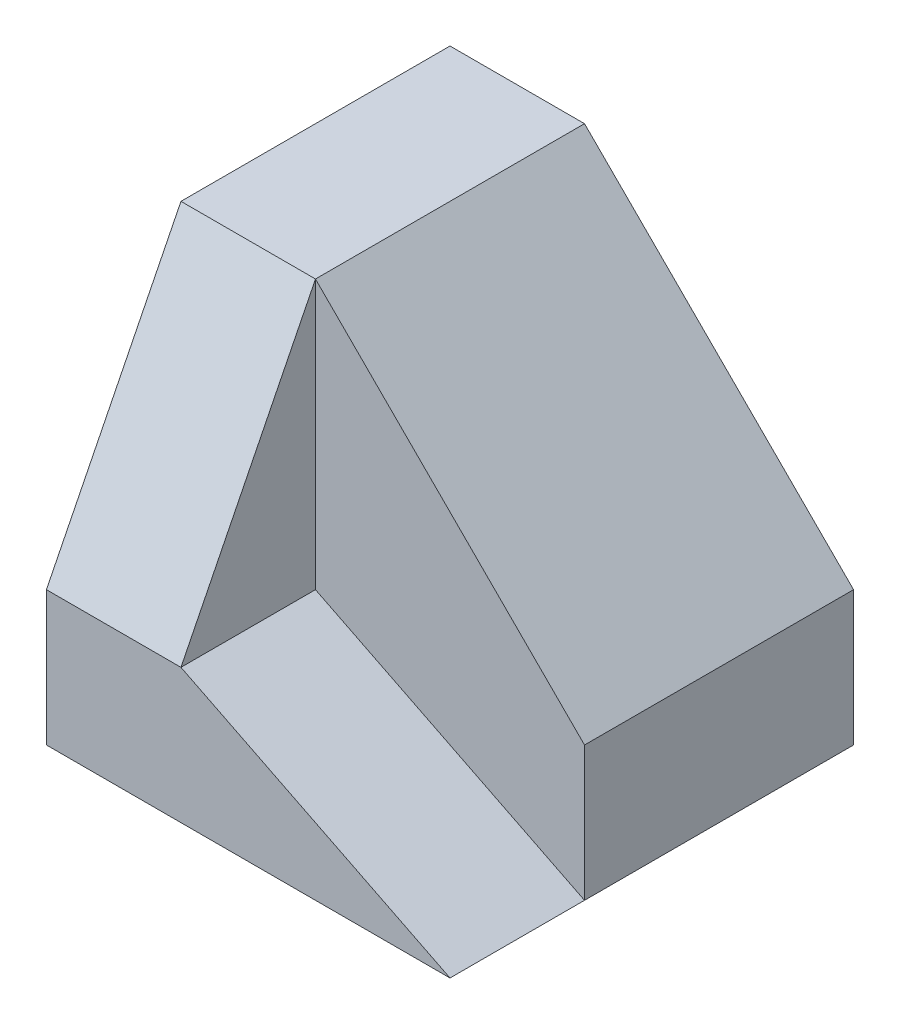
ISO-10303-21;
HEADER;
FILE_DESCRIPTION(('STEP AP214'),'2;1');
FILE_NAME('part.step','',(''),(''),'','','');
FILE_SCHEMA(('AUTOMOTIVE_DESIGN { 1 0 10303 214 1 1 1 1 }'));
ENDSEC;
DATA;
#1=APPLICATION_CONTEXT('core data for automotive mechanical design processes');
#2=APPLICATION_PROTOCOL_DEFINITION('international standard','automotive_design',2000,#1);
#3=PRODUCT_CONTEXT('',#1,'mechanical');
#4=PRODUCT('Part','Part','',(#3));
#5=PRODUCT_RELATED_PRODUCT_CATEGORY('part','',(#4));
#6=PRODUCT_DEFINITION_FORMATION('','',#4);
#7=PRODUCT_DEFINITION_CONTEXT('part definition',#1,'design');
#8=PRODUCT_DEFINITION('design','',#6,#7);
#9=PRODUCT_DEFINITION_SHAPE('','',#8);
#10=(LENGTH_UNIT() NAMED_UNIT(*) SI_UNIT(.MILLI.,.METRE.));
#11=(NAMED_UNIT(*) PLANE_ANGLE_UNIT() SI_UNIT($,.RADIAN.));
#12=(NAMED_UNIT(*) SI_UNIT($,.STERADIAN.) SOLID_ANGLE_UNIT());
#13=UNCERTAINTY_MEASURE_WITH_UNIT(LENGTH_MEASURE(1.E-05),#10,'distance_accuracy_value','');
#14=(GEOMETRIC_REPRESENTATION_CONTEXT(3) GLOBAL_UNCERTAINTY_ASSIGNED_CONTEXT((#13)) GLOBAL_UNIT_ASSIGNED_CONTEXT((#10,
#11,#12)) REPRESENTATION_CONTEXT('',''));
#15=CARTESIAN_POINT('',(0.,0.,0.));
#16=DIRECTION('',(0.,0.,1.));
#17=DIRECTION('',(1.,0.,0.));
#18=AXIS2_PLACEMENT_3D('',#15,#16,#17);
#19=CARTESIAN_POINT('',(60.,20.,-60.));
#20=DIRECTION('',(0.707106781186547,0.707106781186547,0.));
#21=DIRECTION('',(-0.707106781186548,0.707106781186548,0.));
#22=AXIS2_PLACEMENT_3D('',#19,#20,#21);
#23=PLANE('',#22);
#24=DIRECTION('',(0.,0.,1.));
#25=VECTOR('',#24,1.);
#26=CARTESIAN_POINT('',(20.,60.,-60.));
#27=LINE('',#26,#25);
#28=CARTESIAN_POINT('',(20.,60.,-60.));
#29=VERTEX_POINT('',#28);
#30=CARTESIAN_POINT('',(20.,60.,-20.));
#31=VERTEX_POINT('',#30);
#32=EDGE_CURVE('E43',#29,#31,#27,.T.);
#33=ORIENTED_EDGE('',*,*,#32,.T.);
#34=DIRECTION('',(-0.707106781186548,0.707106781186548,0.));
#35=VECTOR('',#34,1.);
#36=CARTESIAN_POINT('',(60.,20.,-20.));
#37=LINE('',#36,#35);
#38=CARTESIAN_POINT('',(60.,20.,-20.));
#39=VERTEX_POINT('',#38);
#40=EDGE_CURVE('E145',#39,#31,#37,.T.);
#41=ORIENTED_EDGE('',*,*,#40,.F.);
#42=DIRECTION('',(0.,0.,1.));
#43=VECTOR('',#42,1.);
#44=CARTESIAN_POINT('',(60.,20.,-60.));
#45=LINE('',#44,#43);
#46=CARTESIAN_POINT('',(60.,20.,-60.));
#47=VERTEX_POINT('',#46);
#48=EDGE_CURVE('E121',#47,#39,#45,.T.);
#49=ORIENTED_EDGE('',*,*,#48,.F.);
#50=DIRECTION('',(-0.707106781186548,0.707106781186548,0.));
#51=VECTOR('',#50,1.);
#52=CARTESIAN_POINT('',(60.,20.,-60.));
#53=LINE('',#52,#51);
#54=EDGE_CURVE('E128',#47,#29,#53,.T.);
#55=ORIENTED_EDGE('',*,*,#54,.T.);
#56=EDGE_LOOP('',(#33,#41,#49,#55));
#57=FACE_BOUND('',#56,.T.);
#58=ADVANCED_FACE('F33',(#57),#23,.T.);
#59=CARTESIAN_POINT('',(60.,0.,-60.));
#60=DIRECTION('',(1.,0.,0.));
#61=DIRECTION('',(0.,0.,-1.));
#62=AXIS2_PLACEMENT_3D('',#59,#60,#61);
#63=PLANE('',#62);
#64=ORIENTED_EDGE('',*,*,#48,.T.);
#65=DIRECTION('',(0.,1.,0.));
#66=VECTOR('',#65,1.);
#67=CARTESIAN_POINT('',(60.,0.,-20.));
#68=LINE('',#67,#66);
#69=CARTESIAN_POINT('',(60.,0.,-20.));
#70=VERTEX_POINT('',#69);
#71=EDGE_CURVE('E142',#70,#39,#68,.T.);
#72=ORIENTED_EDGE('',*,*,#71,.F.);
#73=DIRECTION('',(0.,0.,1.));
#74=VECTOR('',#73,1.);
#75=CARTESIAN_POINT('',(60.,0.,-60.));
#76=LINE('',#75,#74);
#77=CARTESIAN_POINT('',(60.,0.,-60.));
#78=VERTEX_POINT('',#77);
#79=EDGE_CURVE('E123',#78,#70,#76,.T.);
#80=ORIENTED_EDGE('',*,*,#79,.F.);
#81=DIRECTION('',(0.,1.,0.));
#82=VECTOR('',#81,1.);
#83=CARTESIAN_POINT('',(60.,0.,-60.));
#84=LINE('',#83,#82);
#85=EDGE_CURVE('E132',#78,#47,#84,.T.);
#86=ORIENTED_EDGE('',*,*,#85,.T.);
#87=EDGE_LOOP('',(#64,#72,#80,#86));
#88=FACE_BOUND('',#87,.T.);
#89=ADVANCED_FACE('F166',(#88),#63,.T.);
#90=CARTESIAN_POINT('',(0.,60.,-60.));
#91=DIRECTION('',(-1.,0.,0.));
#92=DIRECTION('',(0.,-1.,0.));
#93=AXIS2_PLACEMENT_3D('',#90,#91,#92);
#94=PLANE('',#93);
#95=DIRECTION('',(0.,0.894427190999916,-0.447213595499958));
#96=VECTOR('',#95,1.);
#97=CARTESIAN_POINT('',(0.,20.,0.));
#98=LINE('',#97,#96);
#99=CARTESIAN_POINT('',(0.,20.,0.));
#100=VERTEX_POINT('',#99);
#101=CARTESIAN_POINT('',(0.,60.,-20.));
#102=VERTEX_POINT('',#101);
#103=EDGE_CURVE('E87',#100,#102,#98,.T.);
#104=ORIENTED_EDGE('',*,*,#103,.T.);
#105=DIRECTION('',(0.,0.,1.));
#106=VECTOR('',#105,1.);
#107=CARTESIAN_POINT('',(0.,60.,-60.));
#108=LINE('',#107,#106);
#109=CARTESIAN_POINT('',(0.,60.,-60.));
#110=VERTEX_POINT('',#109);
#111=EDGE_CURVE('E11',#110,#102,#108,.T.);
#112=ORIENTED_EDGE('',*,*,#111,.F.);
#113=DIRECTION('',(0.,-1.,0.));
#114=VECTOR('',#113,1.);
#115=CARTESIAN_POINT('',(0.,60.,-60.));
#116=LINE('',#115,#114);
#117=CARTESIAN_POINT('',(0.,0.,-60.));
#118=VERTEX_POINT('',#117);
#119=EDGE_CURVE('E110',#110,#118,#116,.T.);
#120=ORIENTED_EDGE('',*,*,#119,.T.);
#121=DIRECTION('',(0.,0.,1.));
#122=VECTOR('',#121,1.);
#123=CARTESIAN_POINT('',(0.,0.,-60.));
#124=LINE('',#123,#122);
#125=CARTESIAN_POINT('',(0.,0.,0.));
#126=VERTEX_POINT('',#125);
#127=EDGE_CURVE('E37',#118,#126,#124,.T.);
#128=ORIENTED_EDGE('',*,*,#127,.T.);
#129=DIRECTION('',(0.,-1.,0.));
#130=VECTOR('',#129,1.);
#131=CARTESIAN_POINT('',(0.,60.,0.));
#132=LINE('',#131,#130);
#133=EDGE_CURVE('E102',#100,#126,#132,.T.);
#134=ORIENTED_EDGE('',*,*,#133,.F.);
#135=EDGE_LOOP('',(#104,#112,#120,#128,#134));
#136=FACE_BOUND('',#135,.T.);
#137=ADVANCED_FACE('F35',(#136),#94,.T.);
#138=CARTESIAN_POINT('',(20.,60.,-60.));
#139=DIRECTION('',(0.,1.,0.));
#140=DIRECTION('',(0.,0.,1.));
#141=AXIS2_PLACEMENT_3D('',#138,#139,#140);
#142=PLANE('',#141);
#143=DIRECTION('',(1.,0.,0.));
#144=VECTOR('',#143,1.);
#145=CARTESIAN_POINT('',(-0.00100000000000794,60.,-20.));
#146=LINE('',#145,#144);
#147=EDGE_CURVE('E93',#102,#31,#146,.T.);
#148=ORIENTED_EDGE('',*,*,#147,.T.);
#149=ORIENTED_EDGE('',*,*,#32,.F.);
#150=DIRECTION('',(-1.,0.,0.));
#151=VECTOR('',#150,1.);
#152=CARTESIAN_POINT('',(20.,60.,-60.));
#153=LINE('',#152,#151);
#154=EDGE_CURVE('E116',#29,#110,#153,.T.);
#155=ORIENTED_EDGE('',*,*,#154,.T.);
#156=ORIENTED_EDGE('',*,*,#111,.T.);
#157=EDGE_LOOP('',(#148,#149,#155,#156));
#158=FACE_BOUND('',#157,.T.);
#159=ADVANCED_FACE('F158',(#158),#142,.T.);
#160=CARTESIAN_POINT('',(0.,0.,-60.));
#161=DIRECTION('',(0.,-1.,0.));
#162=DIRECTION('',(0.,0.,-1.));
#163=AXIS2_PLACEMENT_3D('',#160,#161,#162);
#164=PLANE('',#163);
#165=DIRECTION('',(1.,0.,0.));
#166=VECTOR('',#165,1.);
#167=CARTESIAN_POINT('',(0.,0.,0.));
#168=LINE('',#167,#166);
#169=CARTESIAN_POINT('',(60.,0.,0.));
#170=VERTEX_POINT('',#169);
#171=EDGE_CURVE('E107',#126,#170,#168,.T.);
#172=ORIENTED_EDGE('',*,*,#171,.F.);
#173=ORIENTED_EDGE('',*,*,#127,.F.);
#174=DIRECTION('',(1.,0.,0.));
#175=VECTOR('',#174,1.);
#176=CARTESIAN_POINT('',(0.,0.,-60.));
#177=LINE('',#176,#175);
#178=EDGE_CURVE('E136',#118,#78,#177,.T.);
#179=ORIENTED_EDGE('',*,*,#178,.T.);
#180=ORIENTED_EDGE('',*,*,#79,.T.);
#181=DIRECTION('',(0.,0.,1.));
#182=VECTOR('',#181,1.);
#183=CARTESIAN_POINT('',(60.,0.,-20.));
#184=LINE('',#183,#182);
#185=EDGE_CURVE('E108',#70,#170,#184,.T.);
#186=ORIENTED_EDGE('',*,*,#185,.T.);
#187=EDGE_LOOP('',(#172,#173,#179,#180,#186));
#188=FACE_BOUND('',#187,.T.);
#189=ADVANCED_FACE('F175',(#188),#164,.T.);
#190=CARTESIAN_POINT('',(0.,0.,-60.));
#191=DIRECTION('',(0.,0.,1.));
#192=DIRECTION('',(1.,0.,0.));
#193=AXIS2_PLACEMENT_3D('',#190,#191,#192);
#194=PLANE('',#193);
#195=ORIENTED_EDGE('',*,*,#119,.F.);
#196=ORIENTED_EDGE('',*,*,#154,.F.);
#197=ORIENTED_EDGE('',*,*,#54,.F.);
#198=ORIENTED_EDGE('',*,*,#85,.F.);
#199=ORIENTED_EDGE('',*,*,#178,.F.);
#200=EDGE_LOOP('',(#195,#196,#197,#198,#199));
#201=FACE_BOUND('',#200,.T.);
#202=ADVANCED_FACE('F177',(#201),#194,.F.);
#203=CARTESIAN_POINT('',(0.,0.,0.));
#204=DIRECTION('',(0.,0.,1.));
#205=DIRECTION('',(1.,0.,0.));
#206=AXIS2_PLACEMENT_3D('',#203,#204,#205);
#207=PLANE('',#206);
#208=DIRECTION('',(1.,0.,0.));
#209=VECTOR('',#208,1.);
#210=CARTESIAN_POINT('',(-0.00100000000000447,20.,0.));
#211=LINE('',#210,#209);
#212=CARTESIAN_POINT('',(20.,20.,0.));
#213=VERTEX_POINT('',#212);
#214=EDGE_CURVE('E90',#100,#213,#211,.T.);
#215=ORIENTED_EDGE('',*,*,#214,.F.);
#216=ORIENTED_EDGE('',*,*,#133,.T.);
#217=ORIENTED_EDGE('',*,*,#171,.T.);
#218=DIRECTION('',(0.894427190999916,-0.447213595499958,0.));
#219=VECTOR('',#218,1.);
#220=CARTESIAN_POINT('',(20.,20.,0.));
#221=LINE('',#220,#219);
#222=EDGE_CURVE('E95',#213,#170,#221,.T.);
#223=ORIENTED_EDGE('',*,*,#222,.F.);
#224=EDGE_LOOP('',(#215,#216,#217,#223));
#225=FACE_BOUND('',#224,.T.);
#226=ADVANCED_FACE('F100',(#225),#207,.T.);
#227=CARTESIAN_POINT('',(20.,20.,-20.));
#228=DIRECTION('',(-0.447213595499958,-0.894427190999916,0.));
#229=DIRECTION('',(0.894427190999916,-0.447213595499958,0.));
#230=AXIS2_PLACEMENT_3D('',#227,#228,#229);
#231=PLANE('',#230);
#232=ORIENTED_EDGE('',*,*,#222,.T.);
#233=ORIENTED_EDGE('',*,*,#185,.F.);
#234=DIRECTION('',(0.894427190999916,-0.447213595499958,0.));
#235=VECTOR('',#234,1.);
#236=CARTESIAN_POINT('',(20.,20.,-20.));
#237=LINE('',#236,#235);
#238=CARTESIAN_POINT('',(20.,20.,-20.));
#239=VERTEX_POINT('',#238);
#240=EDGE_CURVE('E147',#239,#70,#237,.T.);
#241=ORIENTED_EDGE('',*,*,#240,.F.);
#242=DIRECTION('',(0.,0.,1.));
#243=VECTOR('',#242,1.);
#244=CARTESIAN_POINT('',(20.,20.,-20.));
#245=LINE('',#244,#243);
#246=EDGE_CURVE('E113',#239,#213,#245,.T.);
#247=ORIENTED_EDGE('',*,*,#246,.T.);
#248=EDGE_LOOP('',(#232,#233,#241,#247));
#249=FACE_BOUND('',#248,.T.);
#250=ADVANCED_FACE('F186',(#249),#231,.F.);
#251=CARTESIAN_POINT('',(20.,60.,-20.));
#252=DIRECTION('',(-1.,0.,0.));
#253=DIRECTION('',(0.,-1.,0.));
#254=AXIS2_PLACEMENT_3D('',#251,#252,#253);
#255=PLANE('',#254);
#256=DIRECTION('',(0.,-1.,0.));
#257=VECTOR('',#256,1.);
#258=CARTESIAN_POINT('',(20.,60.,-20.));
#259=LINE('',#258,#257);
#260=EDGE_CURVE('E150',#31,#239,#259,.T.);
#261=ORIENTED_EDGE('',*,*,#260,.F.);
#262=DIRECTION('',(0.,0.894427190999916,-0.447213595499958));
#263=VECTOR('',#262,1.);
#264=CARTESIAN_POINT('',(20.,20.,0.));
#265=LINE('',#264,#263);
#266=EDGE_CURVE('E104',#213,#31,#265,.T.);
#267=ORIENTED_EDGE('',*,*,#266,.F.);
#268=ORIENTED_EDGE('',*,*,#246,.F.);
#269=EDGE_LOOP('',(#261,#267,#268));
#270=FACE_BOUND('',#269,.T.);
#271=ADVANCED_FACE('F159',(#270),#255,.F.);
#272=CARTESIAN_POINT('',(0.,0.,-20.));
#273=DIRECTION('',(0.,0.,1.));
#274=DIRECTION('',(1.,0.,0.));
#275=AXIS2_PLACEMENT_3D('',#272,#273,#274);
#276=PLANE('',#275);
#277=ORIENTED_EDGE('',*,*,#40,.T.);
#278=ORIENTED_EDGE('',*,*,#260,.T.);
#279=ORIENTED_EDGE('',*,*,#240,.T.);
#280=ORIENTED_EDGE('',*,*,#71,.T.);
#281=EDGE_LOOP('',(#277,#278,#279,#280));
#282=FACE_BOUND('',#281,.T.);
#283=ADVANCED_FACE('F163',(#282),#276,.T.);
#284=CARTESIAN_POINT('',(-0.00100000000000447,20.,0.));
#285=DIRECTION('',(0.,-0.447213595499958,-0.894427190999916));
#286=DIRECTION('',(0.,0.894427190999916,-0.447213595499958));
#287=AXIS2_PLACEMENT_3D('',#284,#285,#286);
#288=PLANE('',#287);
#289=ORIENTED_EDGE('',*,*,#214,.T.);
#290=ORIENTED_EDGE('',*,*,#266,.T.);
#291=ORIENTED_EDGE('',*,*,#147,.F.);
#292=ORIENTED_EDGE('',*,*,#103,.F.);
#293=EDGE_LOOP('',(#289,#290,#291,#292));
#294=FACE_BOUND('',#293,.T.);
#295=ADVANCED_FACE('F89',(#294),#288,.F.);
#296=CLOSED_SHELL('',(#58,#89,#137,#159,#189,#202,#226,#250,#271,#283,#295));
#297=MANIFOLD_SOLID_BREP('B2',#296);
#298=ADVANCED_BREP_SHAPE_REPRESENTATION('',(#18,#297),#14);
#299=SHAPE_DEFINITION_REPRESENTATION(#9,#298);
ENDSEC;
END-ISO-10303-21;
